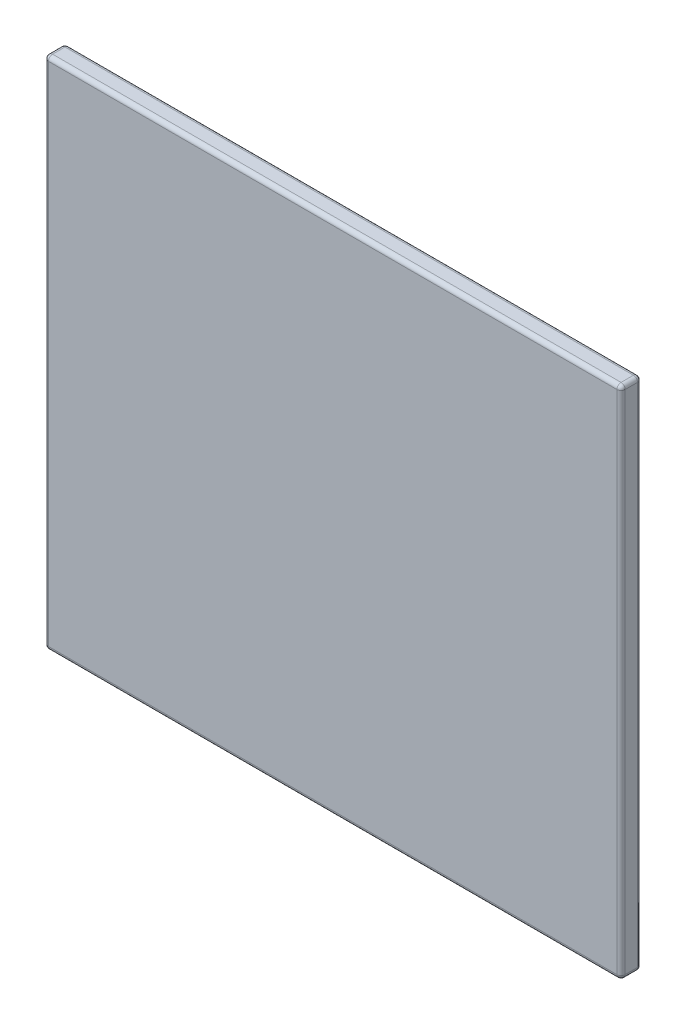
ISO-10303-21;
HEADER;
FILE_DESCRIPTION(('STEP AP214'),'2;1');
FILE_NAME('part.step','',(''),(''),'','','');
FILE_SCHEMA(('AUTOMOTIVE_DESIGN { 1 0 10303 214 1 1 1 1 }'));
ENDSEC;
DATA;
#1=APPLICATION_CONTEXT('core data for automotive mechanical design processes');
#2=APPLICATION_PROTOCOL_DEFINITION('international standard','automotive_design',2000,#1);
#3=PRODUCT_CONTEXT('',#1,'mechanical');
#4=PRODUCT('Part','Part','',(#3));
#5=PRODUCT_RELATED_PRODUCT_CATEGORY('part','',(#4));
#6=PRODUCT_DEFINITION_FORMATION('','',#4);
#7=PRODUCT_DEFINITION_CONTEXT('part definition',#1,'design');
#8=PRODUCT_DEFINITION('design','',#6,#7);
#9=PRODUCT_DEFINITION_SHAPE('','',#8);
#10=(LENGTH_UNIT() NAMED_UNIT(*) SI_UNIT(.MILLI.,.METRE.));
#11=(NAMED_UNIT(*) PLANE_ANGLE_UNIT() SI_UNIT($,.RADIAN.));
#12=(NAMED_UNIT(*) SI_UNIT($,.STERADIAN.) SOLID_ANGLE_UNIT());
#13=UNCERTAINTY_MEASURE_WITH_UNIT(LENGTH_MEASURE(1.E-05),#10,'distance_accuracy_value','');
#14=(GEOMETRIC_REPRESENTATION_CONTEXT(3) GLOBAL_UNCERTAINTY_ASSIGNED_CONTEXT((#13)) GLOBAL_UNIT_ASSIGNED_CONTEXT((#10,
#11,#12)) REPRESENTATION_CONTEXT('',''));
#15=CARTESIAN_POINT('',(0.,0.,0.));
#16=DIRECTION('',(0.,0.,1.));
#17=DIRECTION('',(1.,0.,0.));
#18=AXIS2_PLACEMENT_3D('',#15,#16,#17);
#19=CARTESIAN_POINT('',(0.,0.,0.05));
#20=DIRECTION('',(0.,0.,1.));
#21=DIRECTION('',(1.,0.,0.));
#22=AXIS2_PLACEMENT_3D('',#19,#20,#21);
#23=PLANE('',#22);
#24=DIRECTION('',(0.,1.,0.));
#25=VECTOR('',#24,1.);
#26=CARTESIAN_POINT('',(-0.69,0.3125,0.05));
#27=LINE('',#26,#25);
#28=CARTESIAN_POINT('',(-0.69,-0.615,0.05));
#29=VERTEX_POINT('',#28);
#30=CARTESIAN_POINT('',(-0.69,0.615,0.05));
#31=VERTEX_POINT('',#30);
#32=EDGE_CURVE('E183',#29,#31,#27,.T.);
#33=ORIENTED_EDGE('',*,*,#32,.F.);
#34=DIRECTION('',(-1.,0.,0.));
#35=VECTOR('',#34,1.);
#36=CARTESIAN_POINT('',(-0.35,-0.615,0.05));
#37=LINE('',#36,#35);
#38=CARTESIAN_POINT('',(0.69,-0.615,0.05));
#39=VERTEX_POINT('',#38);
#40=EDGE_CURVE('E26',#39,#29,#37,.T.);
#41=ORIENTED_EDGE('',*,*,#40,.F.);
#42=DIRECTION('',(0.,-1.,0.));
#43=VECTOR('',#42,1.);
#44=CARTESIAN_POINT('',(0.69,-0.3125,0.05));
#45=LINE('',#44,#43);
#46=CARTESIAN_POINT('',(0.69,0.615,0.05));
#47=VERTEX_POINT('',#46);
#48=EDGE_CURVE('E124',#47,#39,#45,.T.);
#49=ORIENTED_EDGE('',*,*,#48,.F.);
#50=DIRECTION('',(1.,0.,0.));
#51=VECTOR('',#50,1.);
#52=CARTESIAN_POINT('',(0.35,0.615,0.05));
#53=LINE('',#52,#51);
#54=EDGE_CURVE('E203',#31,#47,#53,.T.);
#55=ORIENTED_EDGE('',*,*,#54,.F.);
#56=EDGE_LOOP('',(#33,#41,#49,#55));
#57=FACE_BOUND('',#56,.T.);
#58=ADVANCED_FACE('F16',(#57),#23,.T.);
#59=CARTESIAN_POINT('',(0.7,-0.625,0.));
#60=DIRECTION('',(1.,0.,0.));
#61=DIRECTION('',(0.,1.,0.));
#62=AXIS2_PLACEMENT_3D('',#59,#60,#61);
#63=PLANE('',#62);
#64=DIRECTION('',(0.,0.,-1.));
#65=VECTOR('',#64,1.);
#66=CARTESIAN_POINT('',(0.7,0.615,0.));
#67=LINE('',#66,#65);
#68=CARTESIAN_POINT('',(0.7,0.615,0.04));
#69=VERTEX_POINT('',#68);
#70=CARTESIAN_POINT('',(0.7,0.615,0.01));
#71=VERTEX_POINT('',#70);
#72=EDGE_CURVE('E127',#69,#71,#67,.T.);
#73=ORIENTED_EDGE('',*,*,#72,.F.);
#74=DIRECTION('',(0.,1.,0.));
#75=VECTOR('',#74,1.);
#76=CARTESIAN_POINT('',(0.7,-0.3125,0.04));
#77=LINE('',#76,#75);
#78=CARTESIAN_POINT('',(0.7,-0.615,0.04));
#79=VERTEX_POINT('',#78);
#80=EDGE_CURVE('E113',#79,#69,#77,.T.);
#81=ORIENTED_EDGE('',*,*,#80,.F.);
#82=DIRECTION('',(0.,0.,1.));
#83=VECTOR('',#82,1.);
#84=CARTESIAN_POINT('',(0.7,-0.615,0.));
#85=LINE('',#84,#83);
#86=CARTESIAN_POINT('',(0.7,-0.615,0.01));
#87=VERTEX_POINT('',#86);
#88=EDGE_CURVE('E236',#87,#79,#85,.T.);
#89=ORIENTED_EDGE('',*,*,#88,.F.);
#90=DIRECTION('',(0.,-1.,0.));
#91=VECTOR('',#90,1.);
#92=CARTESIAN_POINT('',(0.7,-0.3125,0.01));
#93=LINE('',#92,#91);
#94=EDGE_CURVE('E131',#71,#87,#93,.T.);
#95=ORIENTED_EDGE('',*,*,#94,.F.);
#96=EDGE_LOOP('',(#73,#81,#89,#95));
#97=FACE_BOUND('',#96,.T.);
#98=ADVANCED_FACE('F129',(#97),#63,.T.);
#99=CARTESIAN_POINT('',(0.,0.,0.));
#100=DIRECTION('',(0.,0.,1.));
#101=DIRECTION('',(1.,0.,0.));
#102=AXIS2_PLACEMENT_3D('',#99,#100,#101);
#103=PLANE('',#102);
#104=DIRECTION('',(-1.,0.,0.));
#105=VECTOR('',#104,1.);
#106=CARTESIAN_POINT('',(0.35,0.615,0.));
#107=LINE('',#106,#105);
#108=CARTESIAN_POINT('',(0.69,0.615,0.));
#109=VERTEX_POINT('',#108);
#110=CARTESIAN_POINT('',(-0.69,0.615,0.));
#111=VERTEX_POINT('',#110);
#112=EDGE_CURVE('E163',#109,#111,#107,.T.);
#113=ORIENTED_EDGE('',*,*,#112,.F.);
#114=DIRECTION('',(0.,1.,0.));
#115=VECTOR('',#114,1.);
#116=CARTESIAN_POINT('',(0.69,-0.3125,0.));
#117=LINE('',#116,#115);
#118=CARTESIAN_POINT('',(0.69,-0.615,0.));
#119=VERTEX_POINT('',#118);
#120=EDGE_CURVE('E184',#119,#109,#117,.T.);
#121=ORIENTED_EDGE('',*,*,#120,.F.);
#122=DIRECTION('',(1.,0.,0.));
#123=VECTOR('',#122,1.);
#124=CARTESIAN_POINT('',(-0.35,-0.615,0.));
#125=LINE('',#124,#123);
#126=CARTESIAN_POINT('',(-0.69,-0.615,0.));
#127=VERTEX_POINT('',#126);
#128=EDGE_CURVE('E180',#127,#119,#125,.T.);
#129=ORIENTED_EDGE('',*,*,#128,.F.);
#130=DIRECTION('',(0.,-1.,0.));
#131=VECTOR('',#130,1.);
#132=CARTESIAN_POINT('',(-0.69,0.3125,0.));
#133=LINE('',#132,#131);
#134=EDGE_CURVE('E39',#111,#127,#133,.T.);
#135=ORIENTED_EDGE('',*,*,#134,.F.);
#136=EDGE_LOOP('',(#113,#121,#129,#135));
#137=FACE_BOUND('',#136,.T.);
#138=ADVANCED_FACE('F302',(#137),#103,.F.);
#139=CARTESIAN_POINT('',(0.7,0.625,0.));
#140=DIRECTION('',(0.,1.,0.));
#141=DIRECTION('',(1.,0.,0.));
#142=AXIS2_PLACEMENT_3D('',#139,#140,#141);
#143=PLANE('',#142);
#144=DIRECTION('',(1.,0.,0.));
#145=VECTOR('',#144,1.);
#146=CARTESIAN_POINT('',(0.35,0.625,0.01));
#147=LINE('',#146,#145);
#148=CARTESIAN_POINT('',(-0.69,0.625,0.01));
#149=VERTEX_POINT('',#148);
#150=CARTESIAN_POINT('',(0.69,0.625,0.01));
#151=VERTEX_POINT('',#150);
#152=EDGE_CURVE('E253',#149,#151,#147,.T.);
#153=ORIENTED_EDGE('',*,*,#152,.F.);
#154=DIRECTION('',(0.,0.,-1.));
#155=VECTOR('',#154,1.);
#156=CARTESIAN_POINT('',(-0.69,0.625,0.));
#157=LINE('',#156,#155);
#158=CARTESIAN_POINT('',(-0.69,0.625,0.04));
#159=VERTEX_POINT('',#158);
#160=EDGE_CURVE('E235',#159,#149,#157,.T.);
#161=ORIENTED_EDGE('',*,*,#160,.F.);
#162=DIRECTION('',(-1.,0.,0.));
#163=VECTOR('',#162,1.);
#164=CARTESIAN_POINT('',(0.35,0.625,0.04));
#165=LINE('',#164,#163);
#166=CARTESIAN_POINT('',(0.69,0.625,0.04));
#167=VERTEX_POINT('',#166);
#168=EDGE_CURVE('E199',#167,#159,#165,.T.);
#169=ORIENTED_EDGE('',*,*,#168,.F.);
#170=DIRECTION('',(0.,0.,1.));
#171=VECTOR('',#170,1.);
#172=CARTESIAN_POINT('',(0.69,0.625,0.));
#173=LINE('',#172,#171);
#174=EDGE_CURVE('E136',#151,#167,#173,.T.);
#175=ORIENTED_EDGE('',*,*,#174,.F.);
#176=EDGE_LOOP('',(#153,#161,#169,#175));
#177=FACE_BOUND('',#176,.T.);
#178=ADVANCED_FACE('F333',(#177),#143,.T.);
#179=CARTESIAN_POINT('',(-0.7,0.625,0.));
#180=DIRECTION('',(-1.,0.,0.));
#181=DIRECTION('',(0.,1.,0.));
#182=AXIS2_PLACEMENT_3D('',#179,#180,#181);
#183=PLANE('',#182);
#184=DIRECTION('',(0.,0.,-1.));
#185=VECTOR('',#184,1.);
#186=CARTESIAN_POINT('',(-0.7,-0.615,0.));
#187=LINE('',#186,#185);
#188=CARTESIAN_POINT('',(-0.7,-0.615,0.04));
#189=VERTEX_POINT('',#188);
#190=CARTESIAN_POINT('',(-0.7,-0.615,0.01));
#191=VERTEX_POINT('',#190);
#192=EDGE_CURVE('E185',#189,#191,#187,.T.);
#193=ORIENTED_EDGE('',*,*,#192,.F.);
#194=DIRECTION('',(0.,-1.,0.));
#195=VECTOR('',#194,1.);
#196=CARTESIAN_POINT('',(-0.7,0.3125,0.04));
#197=LINE('',#196,#195);
#198=CARTESIAN_POINT('',(-0.7,0.615,0.04));
#199=VERTEX_POINT('',#198);
#200=EDGE_CURVE('E198',#199,#189,#197,.T.);
#201=ORIENTED_EDGE('',*,*,#200,.F.);
#202=DIRECTION('',(0.,0.,1.));
#203=VECTOR('',#202,1.);
#204=CARTESIAN_POINT('',(-0.7,0.615,0.));
#205=LINE('',#204,#203);
#206=CARTESIAN_POINT('',(-0.7,0.615,0.01));
#207=VERTEX_POINT('',#206);
#208=EDGE_CURVE('E137',#207,#199,#205,.T.);
#209=ORIENTED_EDGE('',*,*,#208,.F.);
#210=DIRECTION('',(0.,1.,0.));
#211=VECTOR('',#210,1.);
#212=CARTESIAN_POINT('',(-0.7,0.3125,0.01));
#213=LINE('',#212,#211);
#214=EDGE_CURVE('E271',#191,#207,#213,.T.);
#215=ORIENTED_EDGE('',*,*,#214,.F.);
#216=EDGE_LOOP('',(#193,#201,#209,#215));
#217=FACE_BOUND('',#216,.T.);
#218=ADVANCED_FACE('F604',(#217),#183,.T.);
#219=CARTESIAN_POINT('',(-0.7,-0.625,0.));
#220=DIRECTION('',(0.,-1.,0.));
#221=DIRECTION('',(0.,0.,-1.));
#222=AXIS2_PLACEMENT_3D('',#219,#220,#221);
#223=PLANE('',#222);
#224=DIRECTION('',(-1.,0.,0.));
#225=VECTOR('',#224,1.);
#226=CARTESIAN_POINT('',(-0.35,-0.625,0.01));
#227=LINE('',#226,#225);
#228=CARTESIAN_POINT('',(0.69,-0.625,0.01));
#229=VERTEX_POINT('',#228);
#230=CARTESIAN_POINT('',(-0.69,-0.625,0.01));
#231=VERTEX_POINT('',#230);
#232=EDGE_CURVE('E190',#229,#231,#227,.T.);
#233=ORIENTED_EDGE('',*,*,#232,.F.);
#234=DIRECTION('',(0.,0.,-1.));
#235=VECTOR('',#234,1.);
#236=CARTESIAN_POINT('',(0.69,-0.625,0.));
#237=LINE('',#236,#235);
#238=CARTESIAN_POINT('',(0.69,-0.625,0.04));
#239=VERTEX_POINT('',#238);
#240=EDGE_CURVE('E70',#239,#229,#237,.T.);
#241=ORIENTED_EDGE('',*,*,#240,.F.);
#242=DIRECTION('',(1.,0.,0.));
#243=VECTOR('',#242,1.);
#244=CARTESIAN_POINT('',(-0.35,-0.625,0.04));
#245=LINE('',#244,#243);
#246=CARTESIAN_POINT('',(-0.69,-0.625,0.04));
#247=VERTEX_POINT('',#246);
#248=EDGE_CURVE('E11',#247,#239,#245,.T.);
#249=ORIENTED_EDGE('',*,*,#248,.F.);
#250=DIRECTION('',(0.,0.,1.));
#251=VECTOR('',#250,1.);
#252=CARTESIAN_POINT('',(-0.69,-0.625,0.));
#253=LINE('',#252,#251);
#254=EDGE_CURVE('E189',#231,#247,#253,.T.);
#255=ORIENTED_EDGE('',*,*,#254,.F.);
#256=EDGE_LOOP('',(#233,#241,#249,#255));
#257=FACE_BOUND('',#256,.T.);
#258=ADVANCED_FACE('F18',(#257),#223,.T.);
#259=CARTESIAN_POINT('',(-0.35,-0.615,0.04));
#260=DIRECTION('',(1.,0.,0.));
#261=DIRECTION('',(0.,-0.707106781186548,0.707106781186548));
#262=AXIS2_PLACEMENT_3D('',#259,#260,#261);
#263=CYLINDRICAL_SURFACE('',#262,0.01);
#264=CARTESIAN_POINT('',(0.69,-0.615,0.04));
#265=DIRECTION('',(1.,0.,0.));
#266=DIRECTION('',(0.,-1.,0.));
#267=AXIS2_PLACEMENT_3D('',#264,#265,#266);
#268=CIRCLE('',#267,0.01);
#269=EDGE_CURVE('E194',#39,#239,#268,.T.);
#270=ORIENTED_EDGE('',*,*,#269,.F.);
#271=ORIENTED_EDGE('',*,*,#40,.T.);
#272=CARTESIAN_POINT('',(-0.69,-0.615,0.04));
#273=DIRECTION('',(-1.,0.,0.));
#274=DIRECTION('',(0.,0.,1.));
#275=AXIS2_PLACEMENT_3D('',#272,#273,#274);
#276=CIRCLE('',#275,0.01);
#277=EDGE_CURVE('E224',#247,#29,#276,.T.);
#278=ORIENTED_EDGE('',*,*,#277,.F.);
#279=ORIENTED_EDGE('',*,*,#248,.T.);
#280=EDGE_LOOP('',(#270,#271,#278,#279));
#281=FACE_BOUND('',#280,.T.);
#282=ADVANCED_FACE('F603',(#281),#263,.T.);
#283=CARTESIAN_POINT('',(0.69,-0.615,0.));
#284=DIRECTION('',(0.,0.,1.));
#285=DIRECTION('',(0.707106781186548,-0.707106781186548,0.));
#286=AXIS2_PLACEMENT_3D('',#283,#284,#285);
#287=CYLINDRICAL_SURFACE('',#286,0.01);
#288=CARTESIAN_POINT('',(0.69,-0.615,0.04));
#289=DIRECTION('',(0.,0.,1.));
#290=DIRECTION('',(1.,0.,0.));
#291=AXIS2_PLACEMENT_3D('',#288,#289,#290);
#292=CIRCLE('',#291,0.01);
#293=EDGE_CURVE('E191',#239,#79,#292,.T.);
#294=ORIENTED_EDGE('',*,*,#293,.F.);
#295=ORIENTED_EDGE('',*,*,#240,.T.);
#296=CARTESIAN_POINT('',(0.69,-0.615,0.01));
#297=DIRECTION('',(0.,0.,-1.));
#298=DIRECTION('',(0.,-1.,0.));
#299=AXIS2_PLACEMENT_3D('',#296,#297,#298);
#300=CIRCLE('',#299,0.01);
#301=EDGE_CURVE('E152',#87,#229,#300,.T.);
#302=ORIENTED_EDGE('',*,*,#301,.F.);
#303=ORIENTED_EDGE('',*,*,#88,.T.);
#304=EDGE_LOOP('',(#294,#295,#302,#303));
#305=FACE_BOUND('',#304,.T.);
#306=ADVANCED_FACE('F344',(#305),#287,.T.);
#307=CARTESIAN_POINT('',(0.69,-0.3125,0.04));
#308=DIRECTION('',(0.,1.,0.));
#309=DIRECTION('',(0.707106781186548,0.,0.707106781186548));
#310=AXIS2_PLACEMENT_3D('',#307,#308,#309);
#311=CYLINDRICAL_SURFACE('',#310,0.01);
#312=CARTESIAN_POINT('',(0.69,0.615,0.04));
#313=DIRECTION('',(0.,1.,0.));
#314=DIRECTION('',(1.,0.,0.));
#315=AXIS2_PLACEMENT_3D('',#312,#313,#314);
#316=CIRCLE('',#315,0.01);
#317=EDGE_CURVE('E118',#47,#69,#316,.T.);
#318=ORIENTED_EDGE('',*,*,#317,.F.);
#319=ORIENTED_EDGE('',*,*,#48,.T.);
#320=CARTESIAN_POINT('',(0.69,-0.615,0.04));
#321=DIRECTION('',(0.,-1.,0.));
#322=DIRECTION('',(0.,0.,1.));
#323=AXIS2_PLACEMENT_3D('',#320,#321,#322);
#324=CIRCLE('',#323,0.01);
#325=EDGE_CURVE('E120',#79,#39,#324,.T.);
#326=ORIENTED_EDGE('',*,*,#325,.F.);
#327=ORIENTED_EDGE('',*,*,#80,.T.);
#328=EDGE_LOOP('',(#318,#319,#326,#327));
#329=FACE_BOUND('',#328,.T.);
#330=ADVANCED_FACE('F115',(#329),#311,.T.);
#331=CARTESIAN_POINT('',(0.35,0.615,0.04));
#332=DIRECTION('',(-1.,0.,0.));
#333=DIRECTION('',(0.,0.707106781186548,0.707106781186548));
#334=AXIS2_PLACEMENT_3D('',#331,#332,#333);
#335=CYLINDRICAL_SURFACE('',#334,0.01);
#336=CARTESIAN_POINT('',(-0.69,0.615,0.04));
#337=DIRECTION('',(-1.,0.,0.));
#338=DIRECTION('',(0.,1.,0.));
#339=AXIS2_PLACEMENT_3D('',#336,#337,#338);
#340=CIRCLE('',#339,0.01);
#341=EDGE_CURVE('E207',#31,#159,#340,.T.);
#342=ORIENTED_EDGE('',*,*,#341,.F.);
#343=ORIENTED_EDGE('',*,*,#54,.T.);
#344=CARTESIAN_POINT('',(0.69,0.615,0.04));
#345=DIRECTION('',(1.,0.,0.));
#346=DIRECTION('',(0.,0.,1.));
#347=AXIS2_PLACEMENT_3D('',#344,#345,#346);
#348=CIRCLE('',#347,0.01);
#349=EDGE_CURVE('E148',#167,#47,#348,.T.);
#350=ORIENTED_EDGE('',*,*,#349,.F.);
#351=ORIENTED_EDGE('',*,*,#168,.T.);
#352=EDGE_LOOP('',(#342,#343,#350,#351));
#353=FACE_BOUND('',#352,.T.);
#354=ADVANCED_FACE('F705',(#353),#335,.T.);
#355=CARTESIAN_POINT('',(-0.69,0.3125,0.04));
#356=DIRECTION('',(0.,-1.,0.));
#357=DIRECTION('',(-0.707106781186548,0.,0.707106781186548));
#358=AXIS2_PLACEMENT_3D('',#355,#356,#357);
#359=CYLINDRICAL_SURFACE('',#358,0.01);
#360=CARTESIAN_POINT('',(-0.69,-0.615,0.04));
#361=DIRECTION('',(0.,-1.,0.));
#362=DIRECTION('',(-1.,0.,0.));
#363=AXIS2_PLACEMENT_3D('',#360,#361,#362);
#364=CIRCLE('',#363,0.01);
#365=EDGE_CURVE('E212',#29,#189,#364,.T.);
#366=ORIENTED_EDGE('',*,*,#365,.F.);
#367=ORIENTED_EDGE('',*,*,#32,.T.);
#368=CARTESIAN_POINT('',(-0.69,0.615,0.04));
#369=DIRECTION('',(0.,1.,0.));
#370=DIRECTION('',(0.,0.,1.));
#371=AXIS2_PLACEMENT_3D('',#368,#369,#370);
#372=CIRCLE('',#371,0.01);
#373=EDGE_CURVE('E223',#199,#31,#372,.T.);
#374=ORIENTED_EDGE('',*,*,#373,.F.);
#375=ORIENTED_EDGE('',*,*,#200,.T.);
#376=EDGE_LOOP('',(#366,#367,#374,#375));
#377=FACE_BOUND('',#376,.T.);
#378=ADVANCED_FACE('F702',(#377),#359,.T.);
#379=CARTESIAN_POINT('',(0.69,-0.3125,0.01));
#380=DIRECTION('',(0.,-1.,0.));
#381=DIRECTION('',(0.707106781186548,0.,-0.707106781186548));
#382=AXIS2_PLACEMENT_3D('',#379,#380,#381);
#383=CYLINDRICAL_SURFACE('',#382,0.01);
#384=CARTESIAN_POINT('',(0.69,-0.615,0.01));
#385=DIRECTION('',(0.,-1.,0.));
#386=DIRECTION('',(1.,0.,0.));
#387=AXIS2_PLACEMENT_3D('',#384,#385,#386);
#388=CIRCLE('',#387,0.01);
#389=EDGE_CURVE('E159',#119,#87,#388,.T.);
#390=ORIENTED_EDGE('',*,*,#389,.F.);
#391=ORIENTED_EDGE('',*,*,#120,.T.);
#392=CARTESIAN_POINT('',(0.69,0.615,0.01));
#393=DIRECTION('',(0.,1.,0.));
#394=DIRECTION('',(0.,0.,-1.));
#395=AXIS2_PLACEMENT_3D('',#392,#393,#394);
#396=CIRCLE('',#395,0.01);
#397=EDGE_CURVE('E262',#71,#109,#396,.T.);
#398=ORIENTED_EDGE('',*,*,#397,.F.);
#399=ORIENTED_EDGE('',*,*,#94,.T.);
#400=EDGE_LOOP('',(#390,#391,#398,#399));
#401=FACE_BOUND('',#400,.T.);
#402=ADVANCED_FACE('F343',(#401),#383,.T.);
#403=CARTESIAN_POINT('',(0.69,0.615,0.));
#404=DIRECTION('',(0.,0.,1.));
#405=DIRECTION('',(0.707106781186548,0.707106781186548,0.));
#406=AXIS2_PLACEMENT_3D('',#403,#404,#405);
#407=CYLINDRICAL_SURFACE('',#406,0.01);
#408=CARTESIAN_POINT('',(0.69,0.615,0.04));
#409=DIRECTION('',(0.,0.,1.));
#410=DIRECTION('',(0.,1.,0.));
#411=AXIS2_PLACEMENT_3D('',#408,#409,#410);
#412=CIRCLE('',#411,0.01);
#413=EDGE_CURVE('E141',#69,#167,#412,.T.);
#414=ORIENTED_EDGE('',*,*,#413,.F.);
#415=ORIENTED_EDGE('',*,*,#72,.T.);
#416=CARTESIAN_POINT('',(0.69,0.615,0.01));
#417=DIRECTION('',(0.,0.,-1.));
#418=DIRECTION('',(1.,0.,0.));
#419=AXIS2_PLACEMENT_3D('',#416,#417,#418);
#420=CIRCLE('',#419,0.01);
#421=EDGE_CURVE('E169',#151,#71,#420,.T.);
#422=ORIENTED_EDGE('',*,*,#421,.F.);
#423=ORIENTED_EDGE('',*,*,#174,.T.);
#424=EDGE_LOOP('',(#414,#415,#422,#423));
#425=FACE_BOUND('',#424,.T.);
#426=ADVANCED_FACE('F142',(#425),#407,.T.);
#427=CARTESIAN_POINT('',(-0.69,0.615,0.));
#428=DIRECTION('',(0.,0.,1.));
#429=DIRECTION('',(-0.707106781186548,0.707106781186548,0.));
#430=AXIS2_PLACEMENT_3D('',#427,#428,#429);
#431=CYLINDRICAL_SURFACE('',#430,0.01);
#432=CARTESIAN_POINT('',(-0.69,0.615,0.04));
#433=DIRECTION('',(0.,0.,1.));
#434=DIRECTION('',(-1.,0.,0.));
#435=AXIS2_PLACEMENT_3D('',#432,#433,#434);
#436=CIRCLE('',#435,0.01);
#437=EDGE_CURVE('E211',#159,#199,#436,.T.);
#438=ORIENTED_EDGE('',*,*,#437,.F.);
#439=ORIENTED_EDGE('',*,*,#160,.T.);
#440=CARTESIAN_POINT('',(-0.69,0.615,0.01));
#441=DIRECTION('',(0.,0.,-1.));
#442=DIRECTION('',(0.,1.,0.));
#443=AXIS2_PLACEMENT_3D('',#440,#441,#442);
#444=CIRCLE('',#443,0.01);
#445=EDGE_CURVE('E165',#207,#149,#444,.T.);
#446=ORIENTED_EDGE('',*,*,#445,.F.);
#447=ORIENTED_EDGE('',*,*,#208,.T.);
#448=EDGE_LOOP('',(#438,#439,#446,#447));
#449=FACE_BOUND('',#448,.T.);
#450=ADVANCED_FACE('F584',(#449),#431,.T.);
#451=CARTESIAN_POINT('',(-0.69,0.3125,0.01));
#452=DIRECTION('',(0.,1.,0.));
#453=DIRECTION('',(-0.707106781186548,0.,-0.707106781186548));
#454=AXIS2_PLACEMENT_3D('',#451,#452,#453);
#455=CYLINDRICAL_SURFACE('',#454,0.01);
#456=CARTESIAN_POINT('',(-0.69,0.615,0.01));
#457=DIRECTION('',(0.,1.,0.));
#458=DIRECTION('',(-1.,0.,0.));
#459=AXIS2_PLACEMENT_3D('',#456,#457,#458);
#460=CIRCLE('',#459,0.01);
#461=EDGE_CURVE('E252',#111,#207,#460,.T.);
#462=ORIENTED_EDGE('',*,*,#461,.F.);
#463=ORIENTED_EDGE('',*,*,#134,.T.);
#464=CARTESIAN_POINT('',(-0.69,-0.615,0.01));
#465=DIRECTION('',(0.,-1.,0.));
#466=DIRECTION('',(0.,0.,-1.));
#467=AXIS2_PLACEMENT_3D('',#464,#465,#466);
#468=CIRCLE('',#467,0.01);
#469=EDGE_CURVE('E176',#191,#127,#468,.T.);
#470=ORIENTED_EDGE('',*,*,#469,.F.);
#471=ORIENTED_EDGE('',*,*,#214,.T.);
#472=EDGE_LOOP('',(#462,#463,#470,#471));
#473=FACE_BOUND('',#472,.T.);
#474=ADVANCED_FACE('F298',(#473),#455,.T.);
#475=CARTESIAN_POINT('',(0.35,0.615,0.01));
#476=DIRECTION('',(1.,0.,0.));
#477=DIRECTION('',(0.,0.707106781186548,-0.707106781186548));
#478=AXIS2_PLACEMENT_3D('',#475,#476,#477);
#479=CYLINDRICAL_SURFACE('',#478,0.01);
#480=CARTESIAN_POINT('',(0.69,0.615,0.01));
#481=DIRECTION('',(1.,0.,0.));
#482=DIRECTION('',(0.,1.,0.));
#483=AXIS2_PLACEMENT_3D('',#480,#481,#482);
#484=CIRCLE('',#483,0.01);
#485=EDGE_CURVE('E206',#109,#151,#484,.T.);
#486=ORIENTED_EDGE('',*,*,#485,.F.);
#487=ORIENTED_EDGE('',*,*,#112,.T.);
#488=CARTESIAN_POINT('',(-0.69,0.615,0.01));
#489=DIRECTION('',(-1.,0.,0.));
#490=DIRECTION('',(0.,0.,-1.));
#491=AXIS2_PLACEMENT_3D('',#488,#489,#490);
#492=CIRCLE('',#491,0.01);
#493=EDGE_CURVE('E168',#149,#111,#492,.T.);
#494=ORIENTED_EDGE('',*,*,#493,.F.);
#495=ORIENTED_EDGE('',*,*,#152,.T.);
#496=EDGE_LOOP('',(#486,#487,#494,#495));
#497=FACE_BOUND('',#496,.T.);
#498=ADVANCED_FACE('F340',(#497),#479,.T.);
#499=CARTESIAN_POINT('',(-0.69,0.615,0.01));
#500=DIRECTION('',(0.408248290463863,-0.408248290463863,-0.816496580927726));
#501=DIRECTION('',(-0.577350269189626,0.577350269189626,-0.577350269189626));
#502=AXIS2_PLACEMENT_3D('',#499,#500,#501);
#503=SPHERICAL_SURFACE('',#502,0.01);
#504=ORIENTED_EDGE('',*,*,#445,.T.);
#505=ORIENTED_EDGE('',*,*,#493,.T.);
#506=ORIENTED_EDGE('',*,*,#461,.T.);
#507=EDGE_LOOP('',(#504,#505,#506));
#508=FACE_BOUND('',#507,.T.);
#509=ADVANCED_FACE('F612',(#508),#503,.T.);
#510=CARTESIAN_POINT('',(0.69,0.615,0.01));
#511=DIRECTION('',(-0.816496580927726,0.408248290463863,-0.408248290463863));
#512=DIRECTION('',(0.577350269189626,0.577350269189626,-0.577350269189626));
#513=AXIS2_PLACEMENT_3D('',#510,#511,#512);
#514=SPHERICAL_SURFACE('',#513,0.01);
#515=ORIENTED_EDGE('',*,*,#397,.T.);
#516=ORIENTED_EDGE('',*,*,#485,.T.);
#517=ORIENTED_EDGE('',*,*,#421,.T.);
#518=EDGE_LOOP('',(#515,#516,#517));
#519=FACE_BOUND('',#518,.T.);
#520=ADVANCED_FACE('F342',(#519),#514,.T.);
#521=CARTESIAN_POINT('',(-0.69,-0.615,0.));
#522=DIRECTION('',(0.,0.,1.));
#523=DIRECTION('',(-0.707106781186548,-0.707106781186548,0.));
#524=AXIS2_PLACEMENT_3D('',#521,#522,#523);
#525=CYLINDRICAL_SURFACE('',#524,0.01);
#526=CARTESIAN_POINT('',(-0.69,-0.615,0.04));
#527=DIRECTION('',(0.,0.,1.));
#528=DIRECTION('',(0.,-1.,0.));
#529=AXIS2_PLACEMENT_3D('',#526,#527,#528);
#530=CIRCLE('',#529,0.01);
#531=EDGE_CURVE('E216',#189,#247,#530,.T.);
#532=ORIENTED_EDGE('',*,*,#531,.F.);
#533=ORIENTED_EDGE('',*,*,#192,.T.);
#534=CARTESIAN_POINT('',(-0.69,-0.615,0.01));
#535=DIRECTION('',(0.,0.,-1.));
#536=DIRECTION('',(-1.,0.,0.));
#537=AXIS2_PLACEMENT_3D('',#534,#535,#536);
#538=CIRCLE('',#537,0.01);
#539=EDGE_CURVE('E175',#231,#191,#538,.T.);
#540=ORIENTED_EDGE('',*,*,#539,.F.);
#541=ORIENTED_EDGE('',*,*,#254,.T.);
#542=EDGE_LOOP('',(#532,#533,#540,#541));
#543=FACE_BOUND('',#542,.T.);
#544=ADVANCED_FACE('F312',(#543),#525,.T.);
#545=CARTESIAN_POINT('',(-0.35,-0.615,0.01));
#546=DIRECTION('',(-1.,0.,0.));
#547=DIRECTION('',(0.,-0.707106781186548,-0.707106781186548));
#548=AXIS2_PLACEMENT_3D('',#545,#546,#547);
#549=CYLINDRICAL_SURFACE('',#548,0.01);
#550=CARTESIAN_POINT('',(-0.69,-0.615,0.01));
#551=DIRECTION('',(-1.,0.,0.));
#552=DIRECTION('',(0.,-1.,0.));
#553=AXIS2_PLACEMENT_3D('',#550,#551,#552);
#554=CIRCLE('',#553,0.01);
#555=EDGE_CURVE('E171',#127,#231,#554,.T.);
#556=ORIENTED_EDGE('',*,*,#555,.F.);
#557=ORIENTED_EDGE('',*,*,#128,.T.);
#558=CARTESIAN_POINT('',(0.69,-0.615,0.01));
#559=DIRECTION('',(1.,0.,0.));
#560=DIRECTION('',(0.,0.,-1.));
#561=AXIS2_PLACEMENT_3D('',#558,#559,#560);
#562=CIRCLE('',#561,0.01);
#563=EDGE_CURVE('E228',#229,#119,#562,.T.);
#564=ORIENTED_EDGE('',*,*,#563,.F.);
#565=ORIENTED_EDGE('',*,*,#232,.T.);
#566=EDGE_LOOP('',(#556,#557,#564,#565));
#567=FACE_BOUND('',#566,.T.);
#568=ADVANCED_FACE('F306',(#567),#549,.T.);
#569=CARTESIAN_POINT('',(-0.69,-0.615,0.01));
#570=DIRECTION('',(0.408248290463863,0.408248290463863,-0.816496580927726));
#571=DIRECTION('',(-0.577350269189626,-0.577350269189626,-0.577350269189626));
#572=AXIS2_PLACEMENT_3D('',#569,#570,#571);
#573=SPHERICAL_SURFACE('',#572,0.01);
#574=ORIENTED_EDGE('',*,*,#469,.T.);
#575=ORIENTED_EDGE('',*,*,#555,.T.);
#576=ORIENTED_EDGE('',*,*,#539,.T.);
#577=EDGE_LOOP('',(#574,#575,#576));
#578=FACE_BOUND('',#577,.T.);
#579=ADVANCED_FACE('F309',(#578),#573,.T.);
#580=CARTESIAN_POINT('',(-0.69,0.615,0.04));
#581=DIRECTION('',(-0.816496580927726,-0.408248290463863,-0.408248290463863));
#582=DIRECTION('',(-0.577350269189626,0.577350269189626,0.577350269189626));
#583=AXIS2_PLACEMENT_3D('',#580,#581,#582);
#584=SPHERICAL_SURFACE('',#583,0.01);
#585=ORIENTED_EDGE('',*,*,#341,.T.);
#586=ORIENTED_EDGE('',*,*,#437,.T.);
#587=ORIENTED_EDGE('',*,*,#373,.T.);
#588=EDGE_LOOP('',(#585,#586,#587));
#589=FACE_BOUND('',#588,.T.);
#590=ADVANCED_FACE('F358',(#589),#584,.T.);
#591=CARTESIAN_POINT('',(0.69,0.615,0.04));
#592=DIRECTION('',(-0.816496580927726,0.408248290463863,0.408248290463863));
#593=DIRECTION('',(0.577350269189626,0.577350269189626,0.577350269189626));
#594=AXIS2_PLACEMENT_3D('',#591,#592,#593);
#595=SPHERICAL_SURFACE('',#594,0.01);
#596=ORIENTED_EDGE('',*,*,#317,.T.);
#597=ORIENTED_EDGE('',*,*,#413,.T.);
#598=ORIENTED_EDGE('',*,*,#349,.T.);
#599=EDGE_LOOP('',(#596,#597,#598));
#600=FACE_BOUND('',#599,.T.);
#601=ADVANCED_FACE('F150',(#600),#595,.T.);
#602=CARTESIAN_POINT('',(0.69,-0.615,0.01));
#603=DIRECTION('',(-0.816496580927726,-0.408248290463863,-0.408248290463863));
#604=DIRECTION('',(0.577350269189626,-0.577350269189626,-0.577350269189626));
#605=AXIS2_PLACEMENT_3D('',#602,#603,#604);
#606=SPHERICAL_SURFACE('',#605,0.01);
#607=ORIENTED_EDGE('',*,*,#563,.T.);
#608=ORIENTED_EDGE('',*,*,#389,.T.);
#609=ORIENTED_EDGE('',*,*,#301,.T.);
#610=EDGE_LOOP('',(#607,#608,#609));
#611=FACE_BOUND('',#610,.T.);
#612=ADVANCED_FACE('F346',(#611),#606,.T.);
#613=CARTESIAN_POINT('',(-0.69,-0.615,0.04));
#614=DIRECTION('',(-0.408248290463863,-0.408248290463863,-0.816496580927726));
#615=DIRECTION('',(-0.577350269189626,-0.577350269189626,0.577350269189626));
#616=AXIS2_PLACEMENT_3D('',#613,#614,#615);
#617=SPHERICAL_SURFACE('',#616,0.01);
#618=ORIENTED_EDGE('',*,*,#365,.T.);
#619=ORIENTED_EDGE('',*,*,#531,.T.);
#620=ORIENTED_EDGE('',*,*,#277,.T.);
#621=EDGE_LOOP('',(#618,#619,#620));
#622=FACE_BOUND('',#621,.T.);
#623=ADVANCED_FACE('F348',(#622),#617,.T.);
#624=CARTESIAN_POINT('',(0.69,-0.615,0.04));
#625=DIRECTION('',(-0.816496580927726,-0.408248290463863,0.408248290463863));
#626=DIRECTION('',(0.577350269189626,-0.577350269189626,0.577350269189626));
#627=AXIS2_PLACEMENT_3D('',#624,#625,#626);
#628=SPHERICAL_SURFACE('',#627,0.01);
#629=ORIENTED_EDGE('',*,*,#269,.T.);
#630=ORIENTED_EDGE('',*,*,#293,.T.);
#631=ORIENTED_EDGE('',*,*,#325,.T.);
#632=EDGE_LOOP('',(#629,#630,#631));
#633=FACE_BOUND('',#632,.T.);
#634=ADVANCED_FACE('F355',(#633),#628,.T.);
#635=CLOSED_SHELL('',(#58,#98,#138,#178,#218,#258,#282,#306,#330,#354,#378,#402,#426,#450,#474,
#498,#509,#520,#544,#568,#579,#590,#601,#612,#623,#634));
#636=MANIFOLD_SOLID_BREP('B1',#635);
#637=ADVANCED_BREP_SHAPE_REPRESENTATION('',(#18,#636),#14);
#638=SHAPE_DEFINITION_REPRESENTATION(#9,#637);
ENDSEC;
END-ISO-10303-21;
